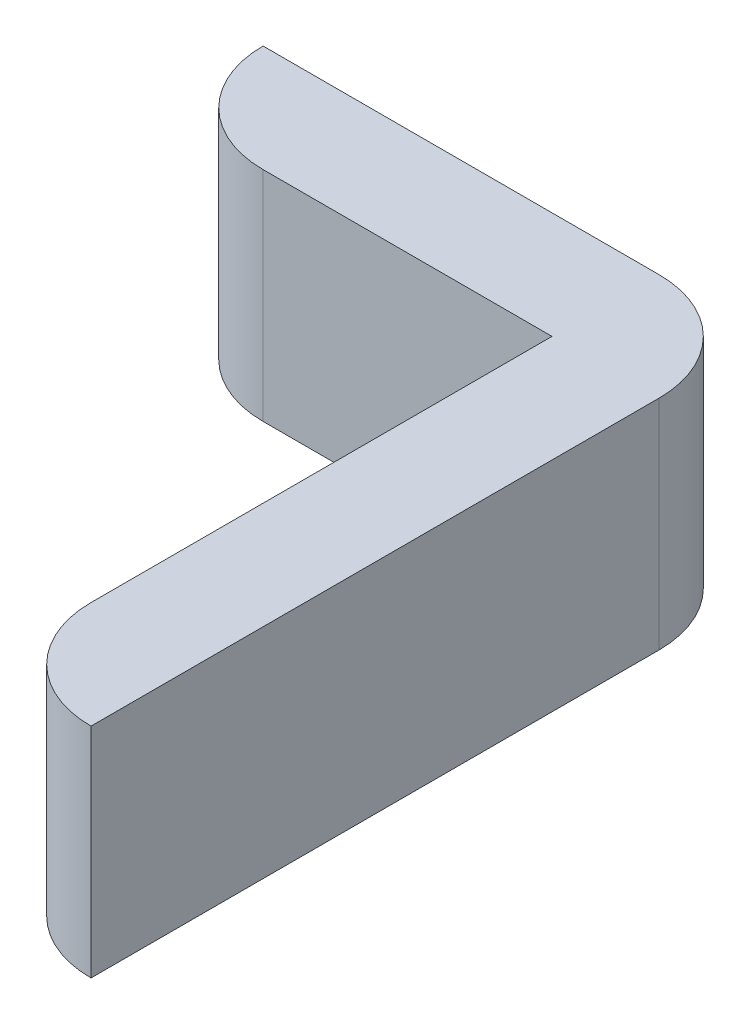
ISO-10303-21;
HEADER;
FILE_DESCRIPTION(('STEP AP214'),'2;1');
FILE_NAME('part.step','',(''),(''),'','','');
FILE_SCHEMA(('AUTOMOTIVE_DESIGN { 1 0 10303 214 1 1 1 1 }'));
ENDSEC;
DATA;
#1=APPLICATION_CONTEXT('core data for automotive mechanical design processes');
#2=APPLICATION_PROTOCOL_DEFINITION('international standard','automotive_design',2000,#1);
#3=PRODUCT_CONTEXT('',#1,'mechanical');
#4=PRODUCT('Part','Part','',(#3));
#5=PRODUCT_RELATED_PRODUCT_CATEGORY('part','',(#4));
#6=PRODUCT_DEFINITION_FORMATION('','',#4);
#7=PRODUCT_DEFINITION_CONTEXT('part definition',#1,'design');
#8=PRODUCT_DEFINITION('design','',#6,#7);
#9=PRODUCT_DEFINITION_SHAPE('','',#8);
#10=(LENGTH_UNIT() NAMED_UNIT(*) SI_UNIT(.MILLI.,.METRE.));
#11=(NAMED_UNIT(*) PLANE_ANGLE_UNIT() SI_UNIT($,.RADIAN.));
#12=(NAMED_UNIT(*) SI_UNIT($,.STERADIAN.) SOLID_ANGLE_UNIT());
#13=UNCERTAINTY_MEASURE_WITH_UNIT(LENGTH_MEASURE(1.E-05),#10,'distance_accuracy_value','');
#14=(GEOMETRIC_REPRESENTATION_CONTEXT(3) GLOBAL_UNCERTAINTY_ASSIGNED_CONTEXT((#13)) GLOBAL_UNIT_ASSIGNED_CONTEXT((#10,
#11,#12)) REPRESENTATION_CONTEXT('',''));
#15=CARTESIAN_POINT('',(0.,0.,0.));
#16=DIRECTION('',(0.,0.,1.));
#17=DIRECTION('',(1.,0.,0.));
#18=AXIS2_PLACEMENT_3D('',#15,#16,#17);
#19=CARTESIAN_POINT('',(9.275,6.6048,0.));
#20=DIRECTION('',(0.,-1.,0.));
#21=DIRECTION('',(0.,0.,-1.));
#22=AXIS2_PLACEMENT_3D('',#19,#20,#21);
#23=PLANE('',#22);
#24=DIRECTION('',(-1.,0.,0.));
#25=VECTOR('',#24,1.);
#26=CARTESIAN_POINT('',(9.525,6.6048,0.25));
#27=LINE('',#26,#25);
#28=CARTESIAN_POINT('',(9.525,6.6048,0.25));
#29=VERTEX_POINT('',#28);
#30=CARTESIAN_POINT('',(10.2,6.6048,0.25));
#31=VERTEX_POINT('',#30);
#32=EDGE_CURVE('E102',#29,#31,#27,.F.);
#33=ORIENTED_EDGE('',*,*,#32,.T.);
#34=DIRECTION('',(0.,0.,-1.));
#35=VECTOR('',#34,1.);
#36=CARTESIAN_POINT('',(10.2,6.6048,0.25));
#37=LINE('',#36,#35);
#38=CARTESIAN_POINT('',(10.2,6.6048,1.327));
#39=VERTEX_POINT('',#38);
#40=EDGE_CURVE('E108',#31,#39,#37,.F.);
#41=ORIENTED_EDGE('',*,*,#40,.T.);
#42=CARTESIAN_POINT('',(10.45,6.6048,1.327));
#43=DIRECTION('',(0.,-1.,0.));
#44=DIRECTION('',(0.,0.,-1.));
#45=AXIS2_PLACEMENT_3D('',#42,#43,#44);
#46=CIRCLE('',#45,0.25);
#47=CARTESIAN_POINT('',(10.45,6.6048,1.577));
#48=VERTEX_POINT('',#47);
#49=EDGE_CURVE('E80',#48,#39,#46,.T.);
#50=ORIENTED_EDGE('',*,*,#49,.F.);
#51=DIRECTION('',(0.,0.,1.));
#52=VECTOR('',#51,1.);
#53=CARTESIAN_POINT('',(10.45,6.6048,1.577));
#54=LINE('',#53,#52);
#55=CARTESIAN_POINT('',(10.45,6.6048,0.25));
#56=VERTEX_POINT('',#55);
#57=EDGE_CURVE('E75',#48,#56,#54,.F.);
#58=ORIENTED_EDGE('',*,*,#57,.T.);
#59=CARTESIAN_POINT('',(10.2,6.6048,0.25));
#60=DIRECTION('',(0.,-1.,0.));
#61=DIRECTION('',(0.,0.,-1.));
#62=AXIS2_PLACEMENT_3D('',#59,#60,#61);
#63=CIRCLE('',#62,0.25);
#64=CARTESIAN_POINT('',(10.2,6.6048,0.));
#65=VERTEX_POINT('',#64);
#66=EDGE_CURVE('E19',#65,#56,#63,.T.);
#67=ORIENTED_EDGE('',*,*,#66,.F.);
#68=DIRECTION('',(1.,0.,0.));
#69=VECTOR('',#68,1.);
#70=CARTESIAN_POINT('',(10.2,6.6048,0.));
#71=LINE('',#70,#69);
#72=CARTESIAN_POINT('',(9.275,6.6048,0.));
#73=VERTEX_POINT('',#72);
#74=EDGE_CURVE('E70',#65,#73,#71,.F.);
#75=ORIENTED_EDGE('',*,*,#74,.T.);
#76=CARTESIAN_POINT('',(9.525,6.6048,0.));
#77=DIRECTION('',(0.,-1.,0.));
#78=DIRECTION('',(0.,0.,-1.));
#79=AXIS2_PLACEMENT_3D('',#76,#77,#78);
#80=CIRCLE('',#79,0.25);
#81=EDGE_CURVE('E121',#29,#73,#80,.T.);
#82=ORIENTED_EDGE('',*,*,#81,.F.);
#83=EDGE_LOOP('',(#33,#41,#50,#58,#67,#75,#82));
#84=FACE_BOUND('',#83,.T.);
#85=ADVANCED_FACE('F16',(#84),#23,.F.);
#86=CARTESIAN_POINT('',(10.2,6.0952,0.));
#87=DIRECTION('',(0.,0.,1.));
#88=DIRECTION('',(1.,0.,0.));
#89=AXIS2_PLACEMENT_3D('',#86,#87,#88);
#90=PLANE('',#89);
#91=DIRECTION('',(0.,-1.,0.));
#92=VECTOR('',#91,1.);
#93=CARTESIAN_POINT('',(9.275,6.0952,0.));
#94=LINE('',#93,#92);
#95=CARTESIAN_POINT('',(9.275,6.0952,0.));
#96=VERTEX_POINT('',#95);
#97=EDGE_CURVE('E123',#73,#96,#94,.T.);
#98=ORIENTED_EDGE('',*,*,#97,.F.);
#99=ORIENTED_EDGE('',*,*,#74,.F.);
#100=DIRECTION('',(0.,-1.,0.));
#101=VECTOR('',#100,1.);
#102=CARTESIAN_POINT('',(10.2,6.0952,0.));
#103=LINE('',#102,#101);
#104=CARTESIAN_POINT('',(10.2,6.0952,0.));
#105=VERTEX_POINT('',#104);
#106=EDGE_CURVE('E92',#105,#65,#103,.F.);
#107=ORIENTED_EDGE('',*,*,#106,.F.);
#108=DIRECTION('',(1.,0.,0.));
#109=VECTOR('',#108,1.);
#110=CARTESIAN_POINT('',(9.275,6.0952,0.));
#111=LINE('',#110,#109);
#112=EDGE_CURVE('E120',#96,#105,#111,.T.);
#113=ORIENTED_EDGE('',*,*,#112,.F.);
#114=EDGE_LOOP('',(#98,#99,#107,#113));
#115=FACE_BOUND('',#114,.T.);
#116=ADVANCED_FACE('F158',(#115),#90,.F.);
#117=CARTESIAN_POINT('',(10.2,6.0952,0.25));
#118=DIRECTION('',(0.,-1.,0.));
#119=DIRECTION('',(0.,0.,-1.));
#120=AXIS2_PLACEMENT_3D('',#117,#118,#119);
#121=CYLINDRICAL_SURFACE('',#120,0.25);
#122=ORIENTED_EDGE('',*,*,#66,.T.);
#123=DIRECTION('',(0.,1.,0.));
#124=VECTOR('',#123,1.);
#125=CARTESIAN_POINT('',(10.45,6.0952,0.25));
#126=LINE('',#125,#124);
#127=CARTESIAN_POINT('',(10.45,6.0952,0.25));
#128=VERTEX_POINT('',#127);
#129=EDGE_CURVE('E86',#56,#128,#126,.F.);
#130=ORIENTED_EDGE('',*,*,#129,.T.);
#131=CARTESIAN_POINT('',(10.2,6.0952,0.25));
#132=DIRECTION('',(0.,-1.,0.));
#133=DIRECTION('',(0.,0.,-1.));
#134=AXIS2_PLACEMENT_3D('',#131,#132,#133);
#135=CIRCLE('',#134,0.25);
#136=EDGE_CURVE('E118',#105,#128,#135,.T.);
#137=ORIENTED_EDGE('',*,*,#136,.F.);
#138=ORIENTED_EDGE('',*,*,#106,.T.);
#139=EDGE_LOOP('',(#122,#130,#137,#138));
#140=FACE_BOUND('',#139,.T.);
#141=ADVANCED_FACE('F89',(#140),#121,.T.);
#142=CARTESIAN_POINT('',(10.45,6.0952,1.577));
#143=DIRECTION('',(-1.,0.,0.));
#144=DIRECTION('',(0.,0.,1.));
#145=AXIS2_PLACEMENT_3D('',#142,#143,#144);
#146=PLANE('',#145);
#147=DIRECTION('',(0.,-1.,0.));
#148=VECTOR('',#147,1.);
#149=CARTESIAN_POINT('',(10.45,6.0952,1.577));
#150=LINE('',#149,#148);
#151=CARTESIAN_POINT('',(10.45,6.0952,1.577));
#152=VERTEX_POINT('',#151);
#153=EDGE_CURVE('E85',#152,#48,#150,.F.);
#154=ORIENTED_EDGE('',*,*,#153,.F.);
#155=DIRECTION('',(0.,0.,-1.));
#156=VECTOR('',#155,1.);
#157=CARTESIAN_POINT('',(10.45,6.0952,0.));
#158=LINE('',#157,#156);
#159=EDGE_CURVE('E94',#128,#152,#158,.F.);
#160=ORIENTED_EDGE('',*,*,#159,.F.);
#161=ORIENTED_EDGE('',*,*,#129,.F.);
#162=ORIENTED_EDGE('',*,*,#57,.F.);
#163=EDGE_LOOP('',(#154,#160,#161,#162));
#164=FACE_BOUND('',#163,.T.);
#165=ADVANCED_FACE('F93',(#164),#146,.F.);
#166=CARTESIAN_POINT('',(10.45,6.0952,1.327));
#167=DIRECTION('',(0.,-1.,0.));
#168=DIRECTION('',(0.,0.,-1.));
#169=AXIS2_PLACEMENT_3D('',#166,#167,#168);
#170=CYLINDRICAL_SURFACE('',#169,0.25);
#171=ORIENTED_EDGE('',*,*,#49,.T.);
#172=DIRECTION('',(0.,1.,0.));
#173=VECTOR('',#172,1.);
#174=CARTESIAN_POINT('',(10.2,6.0952,1.327));
#175=LINE('',#174,#173);
#176=CARTESIAN_POINT('',(10.2,6.0952,1.327));
#177=VERTEX_POINT('',#176);
#178=EDGE_CURVE('E105',#39,#177,#175,.F.);
#179=ORIENTED_EDGE('',*,*,#178,.T.);
#180=CARTESIAN_POINT('',(10.45,6.0952,1.327));
#181=DIRECTION('',(0.,-1.,0.));
#182=DIRECTION('',(0.,0.,-1.));
#183=AXIS2_PLACEMENT_3D('',#180,#181,#182);
#184=CIRCLE('',#183,0.25);
#185=EDGE_CURVE('E114',#152,#177,#184,.T.);
#186=ORIENTED_EDGE('',*,*,#185,.F.);
#187=ORIENTED_EDGE('',*,*,#153,.T.);
#188=EDGE_LOOP('',(#171,#179,#186,#187));
#189=FACE_BOUND('',#188,.T.);
#190=ADVANCED_FACE('F127',(#189),#170,.T.);
#191=CARTESIAN_POINT('',(10.2,6.0952,0.25));
#192=DIRECTION('',(1.,0.,0.));
#193=DIRECTION('',(0.,0.,-1.));
#194=AXIS2_PLACEMENT_3D('',#191,#192,#193);
#195=PLANE('',#194);
#196=ORIENTED_EDGE('',*,*,#178,.F.);
#197=ORIENTED_EDGE('',*,*,#40,.F.);
#198=DIRECTION('',(0.,1.,0.));
#199=VECTOR('',#198,1.);
#200=CARTESIAN_POINT('',(10.2,6.0952,0.25));
#201=LINE('',#200,#199);
#202=CARTESIAN_POINT('',(10.2,6.0952,0.25));
#203=VERTEX_POINT('',#202);
#204=EDGE_CURVE('E104',#31,#203,#201,.F.);
#205=ORIENTED_EDGE('',*,*,#204,.T.);
#206=DIRECTION('',(0.,0.,-1.));
#207=VECTOR('',#206,1.);
#208=CARTESIAN_POINT('',(10.2,6.0952,0.));
#209=LINE('',#208,#207);
#210=EDGE_CURVE('E117',#177,#203,#209,.T.);
#211=ORIENTED_EDGE('',*,*,#210,.F.);
#212=EDGE_LOOP('',(#196,#197,#205,#211));
#213=FACE_BOUND('',#212,.T.);
#214=ADVANCED_FACE('F150',(#213),#195,.F.);
#215=CARTESIAN_POINT('',(9.525,6.0952,0.25));
#216=DIRECTION('',(0.,0.,-1.));
#217=DIRECTION('',(-1.,0.,0.));
#218=AXIS2_PLACEMENT_3D('',#215,#216,#217);
#219=PLANE('',#218);
#220=ORIENTED_EDGE('',*,*,#204,.F.);
#221=ORIENTED_EDGE('',*,*,#32,.F.);
#222=DIRECTION('',(0.,-1.,0.));
#223=VECTOR('',#222,1.);
#224=CARTESIAN_POINT('',(9.525,6.0952,0.25));
#225=LINE('',#224,#223);
#226=CARTESIAN_POINT('',(9.525,6.0952,0.25));
#227=VERTEX_POINT('',#226);
#228=EDGE_CURVE('E34',#227,#29,#225,.F.);
#229=ORIENTED_EDGE('',*,*,#228,.F.);
#230=DIRECTION('',(1.,0.,0.));
#231=VECTOR('',#230,1.);
#232=CARTESIAN_POINT('',(9.275,6.0952,0.25));
#233=LINE('',#232,#231);
#234=EDGE_CURVE('E25',#203,#227,#233,.F.);
#235=ORIENTED_EDGE('',*,*,#234,.F.);
#236=EDGE_LOOP('',(#220,#221,#229,#235));
#237=FACE_BOUND('',#236,.T.);
#238=ADVANCED_FACE('F151',(#237),#219,.F.);
#239=CARTESIAN_POINT('',(9.525,6.0952,0.));
#240=DIRECTION('',(0.,-1.,0.));
#241=DIRECTION('',(0.,0.,-1.));
#242=AXIS2_PLACEMENT_3D('',#239,#240,#241);
#243=CYLINDRICAL_SURFACE('',#242,0.25);
#244=ORIENTED_EDGE('',*,*,#81,.T.);
#245=ORIENTED_EDGE('',*,*,#97,.T.);
#246=CARTESIAN_POINT('',(9.525,6.0952,0.));
#247=DIRECTION('',(0.,-1.,0.));
#248=DIRECTION('',(0.,0.,-1.));
#249=AXIS2_PLACEMENT_3D('',#246,#247,#248);
#250=CIRCLE('',#249,0.25);
#251=EDGE_CURVE('E11',#227,#96,#250,.T.);
#252=ORIENTED_EDGE('',*,*,#251,.F.);
#253=ORIENTED_EDGE('',*,*,#228,.T.);
#254=EDGE_LOOP('',(#244,#245,#252,#253));
#255=FACE_BOUND('',#254,.T.);
#256=ADVANCED_FACE('F156',(#255),#243,.T.);
#257=CARTESIAN_POINT('',(9.275,6.0952,0.));
#258=DIRECTION('',(0.,-1.,0.));
#259=DIRECTION('',(0.,0.,-1.));
#260=AXIS2_PLACEMENT_3D('',#257,#258,#259);
#261=PLANE('',#260);
#262=ORIENTED_EDGE('',*,*,#234,.T.);
#263=ORIENTED_EDGE('',*,*,#251,.T.);
#264=ORIENTED_EDGE('',*,*,#112,.T.);
#265=ORIENTED_EDGE('',*,*,#136,.T.);
#266=ORIENTED_EDGE('',*,*,#159,.T.);
#267=ORIENTED_EDGE('',*,*,#185,.T.);
#268=ORIENTED_EDGE('',*,*,#210,.T.);
#269=EDGE_LOOP('',(#262,#263,#264,#265,#266,#267,#268));
#270=FACE_BOUND('',#269,.T.);
#271=ADVANCED_FACE('F132',(#270),#261,.T.);
#272=CLOSED_SHELL('',(#85,#116,#141,#165,#190,#214,#238,#256,#271));
#273=MANIFOLD_SOLID_BREP('B1',#272);
#274=ADVANCED_BREP_SHAPE_REPRESENTATION('',(#18,#273),#14);
#275=SHAPE_DEFINITION_REPRESENTATION(#9,#274);
ENDSEC;
END-ISO-10303-21;
